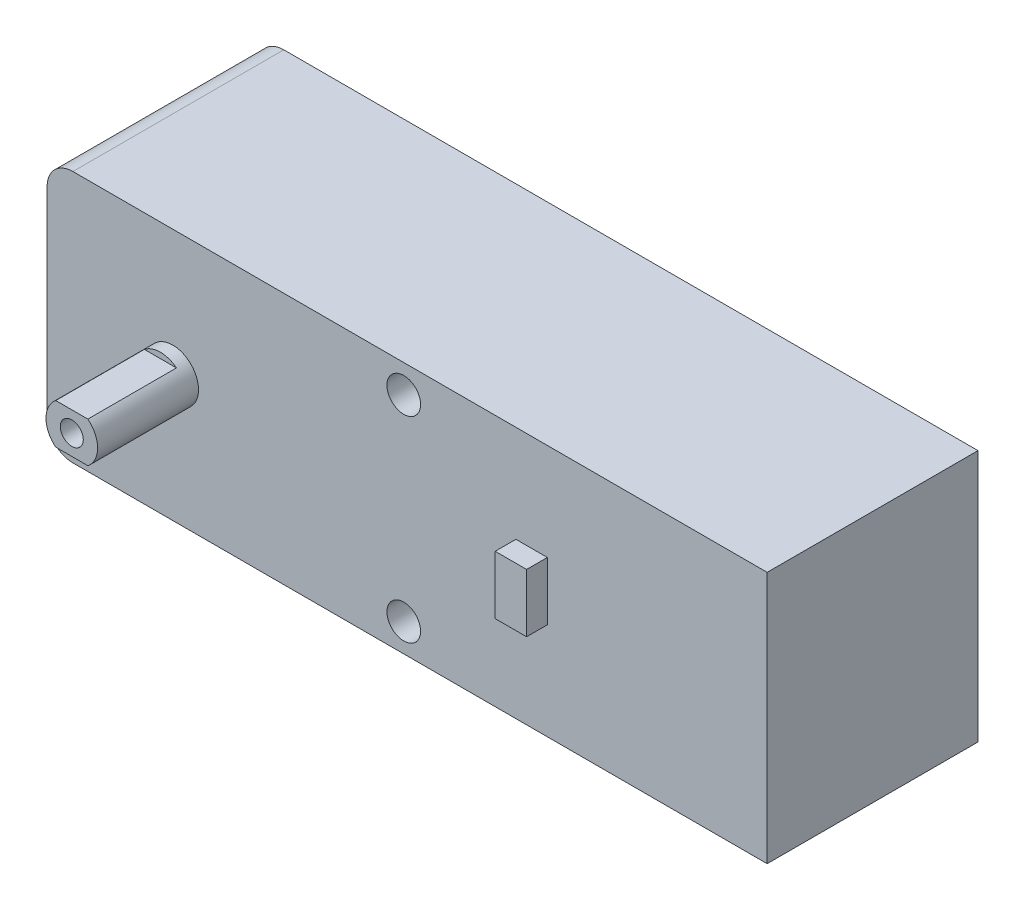
ISO-10303-21;
HEADER;
FILE_DESCRIPTION(('STEP AP214'),'2;1');
FILE_NAME('part.step','',(''),(''),'','','');
FILE_SCHEMA(('AUTOMOTIVE_DESIGN { 1 0 10303 214 1 1 1 1 }'));
ENDSEC;
DATA;
#1=APPLICATION_CONTEXT('core data for automotive mechanical design processes');
#2=APPLICATION_PROTOCOL_DEFINITION('international standard','automotive_design',2000,#1);
#3=PRODUCT_CONTEXT('',#1,'mechanical');
#4=PRODUCT('Part','Part','',(#3));
#5=PRODUCT_RELATED_PRODUCT_CATEGORY('part','',(#4));
#6=PRODUCT_DEFINITION_FORMATION('','',#4);
#7=PRODUCT_DEFINITION_CONTEXT('part definition',#1,'design');
#8=PRODUCT_DEFINITION('design','',#6,#7);
#9=PRODUCT_DEFINITION_SHAPE('','',#8);
#10=(LENGTH_UNIT() NAMED_UNIT(*) SI_UNIT(.MILLI.,.METRE.));
#11=(NAMED_UNIT(*) PLANE_ANGLE_UNIT() SI_UNIT($,.RADIAN.));
#12=(NAMED_UNIT(*) SI_UNIT($,.STERADIAN.) SOLID_ANGLE_UNIT());
#13=UNCERTAINTY_MEASURE_WITH_UNIT(LENGTH_MEASURE(1.E-05),#10,'distance_accuracy_value','');
#14=(GEOMETRIC_REPRESENTATION_CONTEXT(3) GLOBAL_UNCERTAINTY_ASSIGNED_CONTEXT((#13)) GLOBAL_UNIT_ASSIGNED_CONTEXT((#10,
#11,#12)) REPRESENTATION_CONTEXT('',''));
#15=CARTESIAN_POINT('',(0.,0.,0.));
#16=DIRECTION('',(0.,0.,1.));
#17=DIRECTION('',(1.,0.,0.));
#18=AXIS2_PLACEMENT_3D('',#15,#16,#17);
#19=CARTESIAN_POINT('',(0.,0.,9.4));
#20=DIRECTION('',(0.,0.,-1.));
#21=DIRECTION('',(-1.,0.,0.));
#22=AXIS2_PLACEMENT_3D('',#19,#20,#21);
#23=PLANE('',#22);
#24=CARTESIAN_POINT('',(11.2,11.25,9.4));
#25=DIRECTION('',(0.,0.,-1.));
#26=DIRECTION('',(-1.,0.,0.));
#27=AXIS2_PLACEMENT_3D('',#24,#25,#26);
#28=CIRCLE('',#27,2.3);
#29=CARTESIAN_POINT('',(8.9,11.25,9.4));
#30=VERTEX_POINT('',#29);
#31=EDGE_CURVE('E363',#30,#30,#28,.F.);
#32=ORIENTED_EDGE('',*,*,#31,.F.);
#33=EDGE_LOOP('',(#32));
#34=FACE_BOUND('',#33,.T.);
#35=DIRECTION('',(0.,-1.,0.));
#36=VECTOR('',#35,1.);
#37=CARTESIAN_POINT('',(0.,0.,9.4));
#38=LINE('',#37,#36);
#39=CARTESIAN_POINT('',(0.,20.2,9.4));
#40=VERTEX_POINT('',#39);
#41=CARTESIAN_POINT('',(0.,2.3,9.4));
#42=VERTEX_POINT('',#41);
#43=EDGE_CURVE('E328',#40,#42,#38,.T.);
#44=ORIENTED_EDGE('',*,*,#43,.T.);
#45=CARTESIAN_POINT('',(2.3,2.3,9.4));
#46=DIRECTION('',(0.,0.,-1.));
#47=DIRECTION('',(-1.,0.,0.));
#48=AXIS2_PLACEMENT_3D('',#45,#46,#47);
#49=CIRCLE('',#48,2.3);
#50=CARTESIAN_POINT('',(2.3,0.,9.4));
#51=VERTEX_POINT('',#50);
#52=EDGE_CURVE('E61',#42,#51,#49,.F.);
#53=ORIENTED_EDGE('',*,*,#52,.T.);
#54=DIRECTION('',(1.,0.,0.));
#55=VECTOR('',#54,1.);
#56=CARTESIAN_POINT('',(0.,0.,9.4));
#57=LINE('',#56,#55);
#58=CARTESIAN_POINT('',(64.2,0.,9.4));
#59=VERTEX_POINT('',#58);
#60=EDGE_CURVE('E332',#51,#59,#57,.T.);
#61=ORIENTED_EDGE('',*,*,#60,.T.);
#62=DIRECTION('',(0.,1.,0.));
#63=VECTOR('',#62,1.);
#64=CARTESIAN_POINT('',(64.2,0.,9.4));
#65=LINE('',#64,#63);
#66=CARTESIAN_POINT('',(64.2,22.5,9.4));
#67=VERTEX_POINT('',#66);
#68=EDGE_CURVE('E336',#59,#67,#65,.T.);
#69=ORIENTED_EDGE('',*,*,#68,.T.);
#70=DIRECTION('',(-1.,0.,0.));
#71=VECTOR('',#70,1.);
#72=CARTESIAN_POINT('',(0.,22.5,9.4));
#73=LINE('',#72,#71);
#74=CARTESIAN_POINT('',(2.3,22.5,9.4));
#75=VERTEX_POINT('',#74);
#76=EDGE_CURVE('E339',#67,#75,#73,.T.);
#77=ORIENTED_EDGE('',*,*,#76,.T.);
#78=CARTESIAN_POINT('',(2.3,20.2,9.4));
#79=DIRECTION('',(0.,0.,-1.));
#80=DIRECTION('',(-1.,0.,0.));
#81=AXIS2_PLACEMENT_3D('',#78,#79,#80);
#82=CIRCLE('',#81,2.3);
#83=EDGE_CURVE('E388',#75,#40,#82,.F.);
#84=ORIENTED_EDGE('',*,*,#83,.T.);
#85=EDGE_LOOP('',(#44,#53,#61,#69,#77,#84));
#86=FACE_BOUND('',#85,.T.);
#87=CARTESIAN_POINT('',(31.8,20.,9.4));
#88=DIRECTION('',(0.,0.,1.));
#89=DIRECTION('',(1.,0.,0.));
#90=AXIS2_PLACEMENT_3D('',#87,#88,#89);
#91=CIRCLE('',#90,1.5);
#92=CARTESIAN_POINT('',(33.3,20.,9.4));
#93=VERTEX_POINT('',#92);
#94=EDGE_CURVE('E276',#93,#93,#91,.T.);
#95=ORIENTED_EDGE('',*,*,#94,.F.);
#96=EDGE_LOOP('',(#95));
#97=FACE_BOUND('',#96,.T.);
#98=CARTESIAN_POINT('',(31.8,2.5,9.4));
#99=DIRECTION('',(0.,0.,1.));
#100=DIRECTION('',(1.,0.,0.));
#101=AXIS2_PLACEMENT_3D('',#98,#99,#100);
#102=CIRCLE('',#101,1.5);
#103=CARTESIAN_POINT('',(33.3,2.5,9.4));
#104=VERTEX_POINT('',#103);
#105=EDGE_CURVE('E271',#104,#104,#102,.T.);
#106=ORIENTED_EDGE('',*,*,#105,.F.);
#107=EDGE_LOOP('',(#106));
#108=FACE_BOUND('',#107,.T.);
#109=DIRECTION('',(0.,-1.,0.));
#110=VECTOR('',#109,1.);
#111=CARTESIAN_POINT('',(41.8,13.85,9.4));
#112=LINE('',#111,#110);
#113=CARTESIAN_POINT('',(41.8,13.85,9.4));
#114=VERTEX_POINT('',#113);
#115=CARTESIAN_POINT('',(41.8,8.65,9.4));
#116=VERTEX_POINT('',#115);
#117=EDGE_CURVE('E205',#114,#116,#112,.T.);
#118=ORIENTED_EDGE('',*,*,#117,.F.);
#119=DIRECTION('',(-1.,0.,0.));
#120=VECTOR('',#119,1.);
#121=CARTESIAN_POINT('',(41.8,13.85,9.4));
#122=LINE('',#121,#120);
#123=CARTESIAN_POINT('',(44.6,13.85,9.4));
#124=VERTEX_POINT('',#123);
#125=EDGE_CURVE('E202',#124,#114,#122,.T.);
#126=ORIENTED_EDGE('',*,*,#125,.F.);
#127=DIRECTION('',(0.,1.,0.));
#128=VECTOR('',#127,1.);
#129=CARTESIAN_POINT('',(44.6,13.85,9.4));
#130=LINE('',#129,#128);
#131=CARTESIAN_POINT('',(44.6,8.65,9.4));
#132=VERTEX_POINT('',#131);
#133=EDGE_CURVE('E73',#132,#124,#130,.T.);
#134=ORIENTED_EDGE('',*,*,#133,.F.);
#135=DIRECTION('',(1.,0.,0.));
#136=VECTOR('',#135,1.);
#137=CARTESIAN_POINT('',(41.8,8.65,9.4));
#138=LINE('',#137,#136);
#139=EDGE_CURVE('E68',#116,#132,#138,.T.);
#140=ORIENTED_EDGE('',*,*,#139,.F.);
#141=EDGE_LOOP('',(#118,#126,#134,#140));
#142=FACE_BOUND('',#141,.T.);
#143=ADVANCED_FACE('F52',(#34,#86,#97,#108,#142),#23,.F.);
#144=CARTESIAN_POINT('',(11.2,11.25,-18.4));
#145=DIRECTION('',(0.,0.,1.));
#146=DIRECTION('',(1.,0.,0.));
#147=AXIS2_PLACEMENT_3D('',#144,#145,#146);
#148=CYLINDRICAL_SURFACE('',#147,2.3);
#149=CARTESIAN_POINT('',(11.2,11.25,-9.4));
#150=DIRECTION('',(0.,0.,-1.));
#151=DIRECTION('',(-1.,0.,0.));
#152=AXIS2_PLACEMENT_3D('',#149,#150,#151);
#153=CIRCLE('',#152,2.3);
#154=CARTESIAN_POINT('',(8.9,11.25,-9.4));
#155=VERTEX_POINT('',#154);
#156=EDGE_CURVE('E367',#155,#155,#153,.T.);
#157=ORIENTED_EDGE('',*,*,#156,.T.);
#158=EDGE_LOOP('',(#157));
#159=FACE_BOUND('',#158,.T.);
#160=CARTESIAN_POINT('',(11.2,11.25,-10.5));
#161=DIRECTION('',(0.,0.,1.));
#162=DIRECTION('',(1.,0.,0.));
#163=AXIS2_PLACEMENT_3D('',#160,#161,#162);
#164=CIRCLE('',#163,2.3);
#165=CARTESIAN_POINT('',(9.76821789367237,9.45,-10.5));
#166=VERTEX_POINT('',#165);
#167=CARTESIAN_POINT('',(12.6317821063276,9.45,-10.5));
#168=VERTEX_POINT('',#167);
#169=EDGE_CURVE('E222',#166,#168,#164,.T.);
#170=ORIENTED_EDGE('',*,*,#169,.T.);
#171=DIRECTION('',(0.,0.,-1.));
#172=VECTOR('',#171,1.);
#173=CARTESIAN_POINT('',(12.6317821063276,9.45,-10.5));
#174=LINE('',#173,#172);
#175=CARTESIAN_POINT('',(12.6317821063276,9.45,-18.4));
#176=VERTEX_POINT('',#175);
#177=EDGE_CURVE('E233',#168,#176,#174,.T.);
#178=ORIENTED_EDGE('',*,*,#177,.T.);
#179=CARTESIAN_POINT('',(11.2,11.25,-18.4));
#180=DIRECTION('',(0.,0.,1.));
#181=DIRECTION('',(1.,0.,0.));
#182=AXIS2_PLACEMENT_3D('',#179,#180,#181);
#183=CIRCLE('',#182,2.3);
#184=CARTESIAN_POINT('',(12.6317821063276,13.05,-18.4));
#185=VERTEX_POINT('',#184);
#186=EDGE_CURVE('E255',#176,#185,#183,.T.);
#187=ORIENTED_EDGE('',*,*,#186,.T.);
#188=DIRECTION('',(0.,0.,-1.));
#189=VECTOR('',#188,1.);
#190=CARTESIAN_POINT('',(12.6317821063276,13.05,-10.5));
#191=LINE('',#190,#189);
#192=CARTESIAN_POINT('',(12.6317821063276,13.05,-10.5));
#193=VERTEX_POINT('',#192);
#194=EDGE_CURVE('E247',#193,#185,#191,.T.);
#195=ORIENTED_EDGE('',*,*,#194,.F.);
#196=CARTESIAN_POINT('',(11.2,11.25,-10.5));
#197=DIRECTION('',(0.,0.,1.));
#198=DIRECTION('',(1.,0.,0.));
#199=AXIS2_PLACEMENT_3D('',#196,#197,#198);
#200=CIRCLE('',#199,2.3);
#201=CARTESIAN_POINT('',(9.76821789367237,13.05,-10.5));
#202=VERTEX_POINT('',#201);
#203=EDGE_CURVE('E240',#193,#202,#200,.T.);
#204=ORIENTED_EDGE('',*,*,#203,.T.);
#205=DIRECTION('',(0.,0.,-1.));
#206=VECTOR('',#205,1.);
#207=CARTESIAN_POINT('',(9.76821789367237,13.05,-10.5));
#208=LINE('',#207,#206);
#209=CARTESIAN_POINT('',(9.76821789367237,13.05,-18.4));
#210=VERTEX_POINT('',#209);
#211=EDGE_CURVE('E251',#202,#210,#208,.T.);
#212=ORIENTED_EDGE('',*,*,#211,.T.);
#213=CARTESIAN_POINT('',(9.76821789367237,9.45,-18.4));
#214=VERTEX_POINT('',#213);
#215=EDGE_CURVE('E259',#210,#214,#183,.T.);
#216=ORIENTED_EDGE('',*,*,#215,.T.);
#217=DIRECTION('',(0.,0.,-1.));
#218=VECTOR('',#217,1.);
#219=CARTESIAN_POINT('',(9.76821789367237,9.45,-10.5));
#220=LINE('',#219,#218);
#221=EDGE_CURVE('E229',#166,#214,#220,.T.);
#222=ORIENTED_EDGE('',*,*,#221,.F.);
#223=EDGE_LOOP('',(#170,#178,#187,#195,#204,#212,#216,#222));
#224=FACE_BOUND('',#223,.T.);
#225=ADVANCED_FACE('F432',(#159,#224),#148,.T.);
#226=CARTESIAN_POINT('',(11.2,11.25,-18.4));
#227=DIRECTION('',(0.,0.,-1.));
#228=DIRECTION('',(1.,0.,0.));
#229=AXIS2_PLACEMENT_3D('',#226,#227,#228);
#230=PLANE('',#229);
#231=CARTESIAN_POINT('',(11.2,11.25,-18.4));
#232=DIRECTION('',(0.,0.,-1.));
#233=DIRECTION('',(-1.,0.,0.));
#234=AXIS2_PLACEMENT_3D('',#231,#232,#233);
#235=CIRCLE('',#234,1.025);
#236=CARTESIAN_POINT('',(10.175,11.25,-18.4));
#237=VERTEX_POINT('',#236);
#238=EDGE_CURVE('E207',#237,#237,#235,.T.);
#239=ORIENTED_EDGE('',*,*,#238,.F.);
#240=EDGE_LOOP('',(#239));
#241=FACE_BOUND('',#240,.T.);
#242=ORIENTED_EDGE('',*,*,#186,.F.);
#243=DIRECTION('',(-1.,0.,0.));
#244=VECTOR('',#243,1.);
#245=CARTESIAN_POINT('',(12.6317821063276,9.45,-18.4));
#246=LINE('',#245,#244);
#247=EDGE_CURVE('E221',#176,#214,#246,.T.);
#248=ORIENTED_EDGE('',*,*,#247,.T.);
#249=ORIENTED_EDGE('',*,*,#215,.F.);
#250=DIRECTION('',(1.,0.,0.));
#251=VECTOR('',#250,1.);
#252=CARTESIAN_POINT('',(9.76821789367237,13.05,-18.4));
#253=LINE('',#252,#251);
#254=EDGE_CURVE('E237',#210,#185,#253,.T.);
#255=ORIENTED_EDGE('',*,*,#254,.T.);
#256=EDGE_LOOP('',(#242,#248,#249,#255));
#257=FACE_BOUND('',#256,.T.);
#258=ADVANCED_FACE('F440',(#241,#257),#230,.T.);
#259=CARTESIAN_POINT('',(0.,0.,9.4));
#260=DIRECTION('',(1.,0.,0.));
#261=DIRECTION('',(0.,0.,-1.));
#262=AXIS2_PLACEMENT_3D('',#259,#260,#261);
#263=PLANE('',#262);
#264=DIRECTION('',(0.,-1.,0.));
#265=VECTOR('',#264,1.);
#266=CARTESIAN_POINT('',(0.,0.,-9.4));
#267=LINE('',#266,#265);
#268=CARTESIAN_POINT('',(0.,20.2,-9.4));
#269=VERTEX_POINT('',#268);
#270=CARTESIAN_POINT('',(0.,2.3,-9.4));
#271=VERTEX_POINT('',#270);
#272=EDGE_CURVE('E327',#269,#271,#267,.T.);
#273=ORIENTED_EDGE('',*,*,#272,.T.);
#274=DIRECTION('',(0.,0.,-1.));
#275=VECTOR('',#274,1.);
#276=CARTESIAN_POINT('',(0.,2.3,9.4));
#277=LINE('',#276,#275);
#278=EDGE_CURVE('E385',#271,#42,#277,.F.);
#279=ORIENTED_EDGE('',*,*,#278,.T.);
#280=ORIENTED_EDGE('',*,*,#43,.F.);
#281=DIRECTION('',(0.,0.,-1.));
#282=VECTOR('',#281,1.);
#283=CARTESIAN_POINT('',(0.,20.2,9.4));
#284=LINE('',#283,#282);
#285=EDGE_CURVE('E381',#40,#269,#284,.T.);
#286=ORIENTED_EDGE('',*,*,#285,.T.);
#287=EDGE_LOOP('',(#273,#279,#280,#286));
#288=FACE_BOUND('',#287,.T.);
#289=ADVANCED_FACE('F410',(#288),#263,.F.);
#290=CARTESIAN_POINT('',(0.,0.,9.4));
#291=DIRECTION('',(0.,1.,0.));
#292=DIRECTION('',(0.,0.,1.));
#293=AXIS2_PLACEMENT_3D('',#290,#291,#292);
#294=PLANE('',#293);
#295=ORIENTED_EDGE('',*,*,#60,.F.);
#296=DIRECTION('',(0.,0.,-1.));
#297=VECTOR('',#296,1.);
#298=CARTESIAN_POINT('',(2.3,0.,9.4));
#299=LINE('',#298,#297);
#300=CARTESIAN_POINT('',(2.3,0.,-9.4));
#301=VERTEX_POINT('',#300);
#302=EDGE_CURVE('E371',#51,#301,#299,.T.);
#303=ORIENTED_EDGE('',*,*,#302,.T.);
#304=DIRECTION('',(1.,0.,0.));
#305=VECTOR('',#304,1.);
#306=CARTESIAN_POINT('',(0.,0.,-9.4));
#307=LINE('',#306,#305);
#308=CARTESIAN_POINT('',(64.2,0.,-9.4));
#309=VERTEX_POINT('',#308);
#310=EDGE_CURVE('E347',#301,#309,#307,.T.);
#311=ORIENTED_EDGE('',*,*,#310,.T.);
#312=DIRECTION('',(0.,0.,-1.));
#313=VECTOR('',#312,1.);
#314=CARTESIAN_POINT('',(64.2,0.,9.4));
#315=LINE('',#314,#313);
#316=EDGE_CURVE('E359',#59,#309,#315,.T.);
#317=ORIENTED_EDGE('',*,*,#316,.F.);
#318=EDGE_LOOP('',(#295,#303,#311,#317));
#319=FACE_BOUND('',#318,.T.);
#320=ADVANCED_FACE('F401',(#319),#294,.F.);
#321=CARTESIAN_POINT('',(64.2,0.,9.4));
#322=DIRECTION('',(-1.,0.,0.));
#323=DIRECTION('',(0.,0.,1.));
#324=AXIS2_PLACEMENT_3D('',#321,#322,#323);
#325=PLANE('',#324);
#326=DIRECTION('',(0.,1.,0.));
#327=VECTOR('',#326,1.);
#328=CARTESIAN_POINT('',(64.2,0.,-9.4));
#329=LINE('',#328,#327);
#330=CARTESIAN_POINT('',(64.2,22.5,-9.4));
#331=VERTEX_POINT('',#330);
#332=EDGE_CURVE('E350',#309,#331,#329,.T.);
#333=ORIENTED_EDGE('',*,*,#332,.T.);
#334=DIRECTION('',(0.,0.,-1.));
#335=VECTOR('',#334,1.);
#336=CARTESIAN_POINT('',(64.2,22.5,9.4));
#337=LINE('',#336,#335);
#338=EDGE_CURVE('E343',#67,#331,#337,.T.);
#339=ORIENTED_EDGE('',*,*,#338,.F.);
#340=ORIENTED_EDGE('',*,*,#68,.F.);
#341=ORIENTED_EDGE('',*,*,#316,.T.);
#342=EDGE_LOOP('',(#333,#339,#340,#341));
#343=FACE_BOUND('',#342,.T.);
#344=ADVANCED_FACE('F421',(#343),#325,.F.);
#345=CARTESIAN_POINT('',(0.,22.5,9.4));
#346=DIRECTION('',(0.,-1.,0.));
#347=DIRECTION('',(0.,0.,-1.));
#348=AXIS2_PLACEMENT_3D('',#345,#346,#347);
#349=PLANE('',#348);
#350=DIRECTION('',(-1.,0.,0.));
#351=VECTOR('',#350,1.);
#352=CARTESIAN_POINT('',(0.,22.5,-9.4));
#353=LINE('',#352,#351);
#354=CARTESIAN_POINT('',(2.3,22.5,-9.4));
#355=VERTEX_POINT('',#354);
#356=EDGE_CURVE('E333',#331,#355,#353,.T.);
#357=ORIENTED_EDGE('',*,*,#356,.T.);
#358=DIRECTION('',(0.,0.,-1.));
#359=VECTOR('',#358,1.);
#360=CARTESIAN_POINT('',(2.3,22.5,9.4));
#361=LINE('',#360,#359);
#362=EDGE_CURVE('E11',#355,#75,#361,.F.);
#363=ORIENTED_EDGE('',*,*,#362,.T.);
#364=ORIENTED_EDGE('',*,*,#76,.F.);
#365=ORIENTED_EDGE('',*,*,#338,.T.);
#366=EDGE_LOOP('',(#357,#363,#364,#365));
#367=FACE_BOUND('',#366,.T.);
#368=ADVANCED_FACE('F417',(#367),#349,.F.);
#369=CARTESIAN_POINT('',(0.,0.,-9.4));
#370=DIRECTION('',(0.,0.,-1.));
#371=DIRECTION('',(-1.,0.,0.));
#372=AXIS2_PLACEMENT_3D('',#369,#370,#371);
#373=PLANE('',#372);
#374=ORIENTED_EDGE('',*,*,#156,.F.);
#375=EDGE_LOOP('',(#374));
#376=FACE_BOUND('',#375,.T.);
#377=CARTESIAN_POINT('',(31.8,2.5,-9.4));
#378=DIRECTION('',(0.,0.,1.));
#379=DIRECTION('',(1.,0.,0.));
#380=AXIS2_PLACEMENT_3D('',#377,#378,#379);
#381=CIRCLE('',#380,1.5);
#382=CARTESIAN_POINT('',(33.3,2.5,-9.4));
#383=VERTEX_POINT('',#382);
#384=EDGE_CURVE('E272',#383,#383,#381,.T.);
#385=ORIENTED_EDGE('',*,*,#384,.T.);
#386=EDGE_LOOP('',(#385));
#387=FACE_BOUND('',#386,.T.);
#388=CARTESIAN_POINT('',(31.8,20.,-9.4));
#389=DIRECTION('',(0.,0.,1.));
#390=DIRECTION('',(1.,0.,0.));
#391=AXIS2_PLACEMENT_3D('',#388,#389,#390);
#392=CIRCLE('',#391,1.5);
#393=CARTESIAN_POINT('',(33.3,20.,-9.4));
#394=VERTEX_POINT('',#393);
#395=EDGE_CURVE('E280',#394,#394,#392,.T.);
#396=ORIENTED_EDGE('',*,*,#395,.T.);
#397=EDGE_LOOP('',(#396));
#398=FACE_BOUND('',#397,.T.);
#399=ORIENTED_EDGE('',*,*,#310,.F.);
#400=CARTESIAN_POINT('',(2.3,2.3,-9.4));
#401=DIRECTION('',(0.,0.,-1.));
#402=DIRECTION('',(-1.,0.,0.));
#403=AXIS2_PLACEMENT_3D('',#400,#401,#402);
#404=CIRCLE('',#403,2.3);
#405=EDGE_CURVE('E378',#301,#271,#404,.T.);
#406=ORIENTED_EDGE('',*,*,#405,.T.);
#407=ORIENTED_EDGE('',*,*,#272,.F.);
#408=CARTESIAN_POINT('',(2.3,20.2,-9.4));
#409=DIRECTION('',(0.,0.,-1.));
#410=DIRECTION('',(-1.,0.,0.));
#411=AXIS2_PLACEMENT_3D('',#408,#409,#410);
#412=CIRCLE('',#411,2.3);
#413=EDGE_CURVE('E375',#269,#355,#412,.T.);
#414=ORIENTED_EDGE('',*,*,#413,.T.);
#415=ORIENTED_EDGE('',*,*,#356,.F.);
#416=ORIENTED_EDGE('',*,*,#332,.F.);
#417=EDGE_LOOP('',(#399,#406,#407,#414,#415,#416));
#418=FACE_BOUND('',#417,.T.);
#419=ADVANCED_FACE('F407',(#376,#387,#398,#418),#373,.T.);
#420=CARTESIAN_POINT('',(11.2,11.25,18.4));
#421=DIRECTION('',(0.,0.,-1.));
#422=DIRECTION('',(-1.,0.,0.));
#423=AXIS2_PLACEMENT_3D('',#420,#421,#422);
#424=CYLINDRICAL_SURFACE('',#423,2.3);
#425=CARTESIAN_POINT('',(11.2,11.25,18.4));
#426=DIRECTION('',(0.,0.,1.));
#427=DIRECTION('',(1.,0.,0.));
#428=AXIS2_PLACEMENT_3D('',#425,#426,#427);
#429=CIRCLE('',#428,2.3);
#430=CARTESIAN_POINT('',(12.6317821063276,9.45,18.4));
#431=VERTEX_POINT('',#430);
#432=CARTESIAN_POINT('',(12.6317821063276,13.05,18.4));
#433=VERTEX_POINT('',#432);
#434=EDGE_CURVE('E320',#431,#433,#429,.T.);
#435=ORIENTED_EDGE('',*,*,#434,.F.);
#436=DIRECTION('',(0.,0.,1.));
#437=VECTOR('',#436,1.);
#438=CARTESIAN_POINT('',(12.6317821063276,9.45,10.5));
#439=LINE('',#438,#437);
#440=CARTESIAN_POINT('',(12.6317821063276,9.45,10.5));
#441=VERTEX_POINT('',#440);
#442=EDGE_CURVE('E295',#441,#431,#439,.T.);
#443=ORIENTED_EDGE('',*,*,#442,.F.);
#444=CARTESIAN_POINT('',(11.2,11.25,10.5));
#445=DIRECTION('',(0.,0.,1.));
#446=DIRECTION('',(1.,0.,0.));
#447=AXIS2_PLACEMENT_3D('',#444,#445,#446);
#448=CIRCLE('',#447,2.3);
#449=CARTESIAN_POINT('',(9.76821789367237,9.45,10.5));
#450=VERTEX_POINT('',#449);
#451=EDGE_CURVE('E288',#450,#441,#448,.T.);
#452=ORIENTED_EDGE('',*,*,#451,.F.);
#453=DIRECTION('',(0.,0.,1.));
#454=VECTOR('',#453,1.);
#455=CARTESIAN_POINT('',(9.76821789367237,9.45,10.5));
#456=LINE('',#455,#454);
#457=CARTESIAN_POINT('',(9.76821789367237,9.45,18.4));
#458=VERTEX_POINT('',#457);
#459=EDGE_CURVE('E298',#450,#458,#456,.T.);
#460=ORIENTED_EDGE('',*,*,#459,.T.);
#461=CARTESIAN_POINT('',(9.76821789367237,13.05,18.4));
#462=VERTEX_POINT('',#461);
#463=EDGE_CURVE('E323',#462,#458,#429,.T.);
#464=ORIENTED_EDGE('',*,*,#463,.F.);
#465=DIRECTION('',(0.,0.,1.));
#466=VECTOR('',#465,1.);
#467=CARTESIAN_POINT('',(9.76821789367237,13.05,10.5));
#468=LINE('',#467,#466);
#469=CARTESIAN_POINT('',(9.76821789367237,13.05,10.5));
#470=VERTEX_POINT('',#469);
#471=EDGE_CURVE('E312',#470,#462,#468,.T.);
#472=ORIENTED_EDGE('',*,*,#471,.F.);
#473=CARTESIAN_POINT('',(11.2,11.25,10.5));
#474=DIRECTION('',(0.,0.,1.));
#475=DIRECTION('',(1.,0.,0.));
#476=AXIS2_PLACEMENT_3D('',#473,#474,#475);
#477=CIRCLE('',#476,2.3);
#478=CARTESIAN_POINT('',(12.6317821063276,13.05,10.5));
#479=VERTEX_POINT('',#478);
#480=EDGE_CURVE('E305',#479,#470,#477,.T.);
#481=ORIENTED_EDGE('',*,*,#480,.F.);
#482=DIRECTION('',(0.,0.,1.));
#483=VECTOR('',#482,1.);
#484=CARTESIAN_POINT('',(12.6317821063276,13.05,10.5));
#485=LINE('',#484,#483);
#486=EDGE_CURVE('E316',#479,#433,#485,.T.);
#487=ORIENTED_EDGE('',*,*,#486,.T.);
#488=EDGE_LOOP('',(#435,#443,#452,#460,#464,#472,#481,#487));
#489=FACE_BOUND('',#488,.T.);
#490=ORIENTED_EDGE('',*,*,#31,.T.);
#491=EDGE_LOOP('',(#490));
#492=FACE_BOUND('',#491,.T.);
#493=ADVANCED_FACE('F446',(#489,#492),#424,.T.);
#494=CARTESIAN_POINT('',(11.2,11.25,18.4));
#495=DIRECTION('',(0.,0.,1.));
#496=DIRECTION('',(1.,0.,0.));
#497=AXIS2_PLACEMENT_3D('',#494,#495,#496);
#498=PLANE('',#497);
#499=CARTESIAN_POINT('',(11.2,11.25,18.4));
#500=DIRECTION('',(0.,0.,1.));
#501=DIRECTION('',(1.,0.,0.));
#502=AXIS2_PLACEMENT_3D('',#499,#500,#501);
#503=CIRCLE('',#502,1.025);
#504=CARTESIAN_POINT('',(12.225,11.25,18.4));
#505=VERTEX_POINT('',#504);
#506=EDGE_CURVE('E263',#505,#505,#503,.T.);
#507=ORIENTED_EDGE('',*,*,#506,.F.);
#508=EDGE_LOOP('',(#507));
#509=FACE_BOUND('',#508,.T.);
#510=DIRECTION('',(-1.,0.,0.));
#511=VECTOR('',#510,1.);
#512=CARTESIAN_POINT('',(12.6317821063276,9.45,18.4));
#513=LINE('',#512,#511);
#514=EDGE_CURVE('E284',#431,#458,#513,.T.);
#515=ORIENTED_EDGE('',*,*,#514,.F.);
#516=ORIENTED_EDGE('',*,*,#434,.T.);
#517=DIRECTION('',(1.,0.,0.));
#518=VECTOR('',#517,1.);
#519=CARTESIAN_POINT('',(9.76821789367237,13.05,18.4));
#520=LINE('',#519,#518);
#521=EDGE_CURVE('E302',#462,#433,#520,.T.);
#522=ORIENTED_EDGE('',*,*,#521,.F.);
#523=ORIENTED_EDGE('',*,*,#463,.T.);
#524=EDGE_LOOP('',(#515,#516,#522,#523));
#525=FACE_BOUND('',#524,.T.);
#526=ADVANCED_FACE('F453',(#509,#525),#498,.T.);
#527=CARTESIAN_POINT('',(9.76821789367237,13.05,10.5));
#528=DIRECTION('',(0.,-1.,0.));
#529=DIRECTION('',(0.,0.,-1.));
#530=AXIS2_PLACEMENT_3D('',#527,#528,#529);
#531=PLANE('',#530);
#532=ORIENTED_EDGE('',*,*,#521,.T.);
#533=ORIENTED_EDGE('',*,*,#486,.F.);
#534=DIRECTION('',(1.,0.,0.));
#535=VECTOR('',#534,1.);
#536=CARTESIAN_POINT('',(9.76821789367237,13.05,10.5));
#537=LINE('',#536,#535);
#538=EDGE_CURVE('E308',#470,#479,#537,.T.);
#539=ORIENTED_EDGE('',*,*,#538,.F.);
#540=ORIENTED_EDGE('',*,*,#471,.T.);
#541=EDGE_LOOP('',(#532,#533,#539,#540));
#542=FACE_BOUND('',#541,.T.);
#543=ADVANCED_FACE('F552',(#542),#531,.F.);
#544=CARTESIAN_POINT('',(11.2,11.25,10.5));
#545=DIRECTION('',(0.,0.,1.));
#546=DIRECTION('',(1.,0.,0.));
#547=AXIS2_PLACEMENT_3D('',#544,#545,#546);
#548=PLANE('',#547);
#549=ORIENTED_EDGE('',*,*,#480,.T.);
#550=ORIENTED_EDGE('',*,*,#538,.T.);
#551=EDGE_LOOP('',(#549,#550));
#552=FACE_BOUND('',#551,.T.);
#553=ADVANCED_FACE('F548',(#552),#548,.T.);
#554=CARTESIAN_POINT('',(12.6317821063276,9.45,10.5));
#555=DIRECTION('',(0.,1.,0.));
#556=DIRECTION('',(0.,0.,1.));
#557=AXIS2_PLACEMENT_3D('',#554,#555,#556);
#558=PLANE('',#557);
#559=ORIENTED_EDGE('',*,*,#514,.T.);
#560=ORIENTED_EDGE('',*,*,#459,.F.);
#561=DIRECTION('',(-1.,0.,0.));
#562=VECTOR('',#561,1.);
#563=CARTESIAN_POINT('',(12.6317821063276,9.45,10.5));
#564=LINE('',#563,#562);
#565=EDGE_CURVE('E291',#441,#450,#564,.T.);
#566=ORIENTED_EDGE('',*,*,#565,.F.);
#567=ORIENTED_EDGE('',*,*,#442,.T.);
#568=EDGE_LOOP('',(#559,#560,#566,#567));
#569=FACE_BOUND('',#568,.T.);
#570=ADVANCED_FACE('F544',(#569),#558,.F.);
#571=CARTESIAN_POINT('',(11.2,11.25,10.5));
#572=DIRECTION('',(0.,0.,1.));
#573=DIRECTION('',(1.,0.,0.));
#574=AXIS2_PLACEMENT_3D('',#571,#572,#573);
#575=PLANE('',#574);
#576=ORIENTED_EDGE('',*,*,#451,.T.);
#577=ORIENTED_EDGE('',*,*,#565,.T.);
#578=EDGE_LOOP('',(#576,#577));
#579=FACE_BOUND('',#578,.T.);
#580=ADVANCED_FACE('F465',(#579),#575,.T.);
#581=CARTESIAN_POINT('',(31.8,20.,-9.4));
#582=DIRECTION('',(0.,0.,1.));
#583=DIRECTION('',(1.,0.,0.));
#584=AXIS2_PLACEMENT_3D('',#581,#582,#583);
#585=CYLINDRICAL_SURFACE('',#584,1.5);
#586=ORIENTED_EDGE('',*,*,#395,.F.);
#587=EDGE_LOOP('',(#586));
#588=FACE_BOUND('',#587,.T.);
#589=ORIENTED_EDGE('',*,*,#94,.T.);
#590=EDGE_LOOP('',(#589));
#591=FACE_BOUND('',#590,.T.);
#592=ADVANCED_FACE('F461',(#588,#591),#585,.F.);
#593=CARTESIAN_POINT('',(31.8,2.5,-9.4));
#594=DIRECTION('',(0.,0.,1.));
#595=DIRECTION('',(1.,0.,0.));
#596=AXIS2_PLACEMENT_3D('',#593,#594,#595);
#597=CYLINDRICAL_SURFACE('',#596,1.5);
#598=ORIENTED_EDGE('',*,*,#384,.F.);
#599=EDGE_LOOP('',(#598));
#600=FACE_BOUND('',#599,.T.);
#601=ORIENTED_EDGE('',*,*,#105,.T.);
#602=EDGE_LOOP('',(#601));
#603=FACE_BOUND('',#602,.T.);
#604=ADVANCED_FACE('F464',(#600,#603),#597,.F.);
#605=CARTESIAN_POINT('',(11.2,11.25,11.15));
#606=DIRECTION('',(0.,0.,1.));
#607=DIRECTION('',(1.,0.,0.));
#608=AXIS2_PLACEMENT_3D('',#605,#606,#607);
#609=CONICAL_SURFACE('',#608,1.025,1.02974425867665);
#610=CARTESIAN_POINT('',(11.2,11.25,10.5341178654967));
#611=VERTEX_POINT('',#610);
#612=VERTEX_LOOP('',#611);
#613=FACE_BOUND('',#612,.T.);
#614=CARTESIAN_POINT('',(11.2,11.25,11.15));
#615=DIRECTION('',(0.,0.,1.));
#616=DIRECTION('',(1.,0.,0.));
#617=AXIS2_PLACEMENT_3D('',#614,#615,#616);
#618=CIRCLE('',#617,1.025);
#619=CARTESIAN_POINT('',(12.225,11.25,11.15));
#620=VERTEX_POINT('',#619);
#621=EDGE_CURVE('E267',#620,#620,#618,.T.);
#622=ORIENTED_EDGE('',*,*,#621,.T.);
#623=EDGE_LOOP('',(#622));
#624=FACE_BOUND('',#623,.T.);
#625=ADVANCED_FACE('F534',(#613,#624),#609,.F.);
#626=CARTESIAN_POINT('',(11.2,11.25,18.4));
#627=DIRECTION('',(0.,0.,1.));
#628=DIRECTION('',(1.,0.,0.));
#629=AXIS2_PLACEMENT_3D('',#626,#627,#628);
#630=CYLINDRICAL_SURFACE('',#629,1.025);
#631=ORIENTED_EDGE('',*,*,#621,.F.);
#632=EDGE_LOOP('',(#631));
#633=FACE_BOUND('',#632,.T.);
#634=ORIENTED_EDGE('',*,*,#506,.T.);
#635=EDGE_LOOP('',(#634));
#636=FACE_BOUND('',#635,.T.);
#637=ADVANCED_FACE('F527',(#633,#636),#630,.F.);
#638=CARTESIAN_POINT('',(9.76821789367237,13.05,-10.5));
#639=DIRECTION('',(0.,1.,0.));
#640=DIRECTION('',(0.,0.,1.));
#641=AXIS2_PLACEMENT_3D('',#638,#639,#640);
#642=PLANE('',#641);
#643=ORIENTED_EDGE('',*,*,#254,.F.);
#644=ORIENTED_EDGE('',*,*,#211,.F.);
#645=DIRECTION('',(1.,0.,0.));
#646=VECTOR('',#645,1.);
#647=CARTESIAN_POINT('',(9.76821789367237,13.05,-10.5));
#648=LINE('',#647,#646);
#649=EDGE_CURVE('E244',#202,#193,#648,.T.);
#650=ORIENTED_EDGE('',*,*,#649,.T.);
#651=ORIENTED_EDGE('',*,*,#194,.T.);
#652=EDGE_LOOP('',(#643,#644,#650,#651));
#653=FACE_BOUND('',#652,.T.);
#654=ADVANCED_FACE('F523',(#653),#642,.T.);
#655=CARTESIAN_POINT('',(11.2,11.25,-10.5));
#656=DIRECTION('',(0.,0.,-1.));
#657=DIRECTION('',(1.,0.,0.));
#658=AXIS2_PLACEMENT_3D('',#655,#656,#657);
#659=PLANE('',#658);
#660=ORIENTED_EDGE('',*,*,#203,.F.);
#661=ORIENTED_EDGE('',*,*,#649,.F.);
#662=EDGE_LOOP('',(#660,#661));
#663=FACE_BOUND('',#662,.T.);
#664=ADVANCED_FACE('F519',(#663),#659,.T.);
#665=CARTESIAN_POINT('',(12.6317821063276,9.45,-10.5));
#666=DIRECTION('',(0.,-1.,0.));
#667=DIRECTION('',(0.,0.,-1.));
#668=AXIS2_PLACEMENT_3D('',#665,#666,#667);
#669=PLANE('',#668);
#670=ORIENTED_EDGE('',*,*,#247,.F.);
#671=ORIENTED_EDGE('',*,*,#177,.F.);
#672=DIRECTION('',(-1.,0.,0.));
#673=VECTOR('',#672,1.);
#674=CARTESIAN_POINT('',(12.6317821063276,9.45,-10.5));
#675=LINE('',#674,#673);
#676=EDGE_CURVE('E226',#168,#166,#675,.T.);
#677=ORIENTED_EDGE('',*,*,#676,.T.);
#678=ORIENTED_EDGE('',*,*,#221,.T.);
#679=EDGE_LOOP('',(#670,#671,#677,#678));
#680=FACE_BOUND('',#679,.T.);
#681=ADVANCED_FACE('F515',(#680),#669,.T.);
#682=CARTESIAN_POINT('',(11.2,11.25,-10.5));
#683=DIRECTION('',(0.,0.,-1.));
#684=DIRECTION('',(1.,0.,0.));
#685=AXIS2_PLACEMENT_3D('',#682,#683,#684);
#686=PLANE('',#685);
#687=ORIENTED_EDGE('',*,*,#169,.F.);
#688=ORIENTED_EDGE('',*,*,#676,.F.);
#689=EDGE_LOOP('',(#687,#688));
#690=FACE_BOUND('',#689,.T.);
#691=ADVANCED_FACE('F511',(#690),#686,.T.);
#692=CARTESIAN_POINT('',(11.2,11.25,-11.15));
#693=DIRECTION('',(0.,0.,-1.));
#694=DIRECTION('',(-1.,0.,0.));
#695=AXIS2_PLACEMENT_3D('',#692,#693,#694);
#696=CONICAL_SURFACE('',#695,1.025,1.02974425867665);
#697=CARTESIAN_POINT('',(11.2,11.25,-10.5341178654967));
#698=VERTEX_POINT('',#697);
#699=VERTEX_LOOP('',#698);
#700=FACE_BOUND('',#699,.T.);
#701=CARTESIAN_POINT('',(11.2,11.25,-11.15));
#702=DIRECTION('',(0.,0.,-1.));
#703=DIRECTION('',(-1.,0.,0.));
#704=AXIS2_PLACEMENT_3D('',#701,#702,#703);
#705=CIRCLE('',#704,1.025);
#706=CARTESIAN_POINT('',(10.175,11.25,-11.15));
#707=VERTEX_POINT('',#706);
#708=EDGE_CURVE('E212',#707,#707,#705,.T.);
#709=ORIENTED_EDGE('',*,*,#708,.T.);
#710=EDGE_LOOP('',(#709));
#711=FACE_BOUND('',#710,.T.);
#712=ADVANCED_FACE('F507',(#700,#711),#696,.F.);
#713=CARTESIAN_POINT('',(11.2,11.25,-18.4));
#714=DIRECTION('',(0.,0.,-1.));
#715=DIRECTION('',(-1.,0.,0.));
#716=AXIS2_PLACEMENT_3D('',#713,#714,#715);
#717=CYLINDRICAL_SURFACE('',#716,1.025);
#718=ORIENTED_EDGE('',*,*,#708,.F.);
#719=EDGE_LOOP('',(#718));
#720=FACE_BOUND('',#719,.T.);
#721=ORIENTED_EDGE('',*,*,#238,.T.);
#722=EDGE_LOOP('',(#721));
#723=FACE_BOUND('',#722,.T.);
#724=ADVANCED_FACE('F504',(#720,#723),#717,.F.);
#725=CARTESIAN_POINT('',(2.3,2.3,9.4));
#726=DIRECTION('',(0.,0.,-1.));
#727=DIRECTION('',(-1.,0.,0.));
#728=AXIS2_PLACEMENT_3D('',#725,#726,#727);
#729=CYLINDRICAL_SURFACE('',#728,2.3);
#730=ORIENTED_EDGE('',*,*,#52,.F.);
#731=ORIENTED_EDGE('',*,*,#278,.F.);
#732=ORIENTED_EDGE('',*,*,#405,.F.);
#733=ORIENTED_EDGE('',*,*,#302,.F.);
#734=EDGE_LOOP('',(#730,#731,#732,#733));
#735=FACE_BOUND('',#734,.T.);
#736=ADVANCED_FACE('F404',(#735),#729,.T.);
#737=CARTESIAN_POINT('',(2.3,20.2,9.4));
#738=DIRECTION('',(0.,0.,-1.));
#739=DIRECTION('',(-1.,0.,0.));
#740=AXIS2_PLACEMENT_3D('',#737,#738,#739);
#741=CYLINDRICAL_SURFACE('',#740,2.3);
#742=ORIENTED_EDGE('',*,*,#83,.F.);
#743=ORIENTED_EDGE('',*,*,#362,.F.);
#744=ORIENTED_EDGE('',*,*,#413,.F.);
#745=ORIENTED_EDGE('',*,*,#285,.F.);
#746=EDGE_LOOP('',(#742,#743,#744,#745));
#747=FACE_BOUND('',#746,.T.);
#748=ADVANCED_FACE('F54',(#747),#741,.T.);
#749=CARTESIAN_POINT('',(41.8,13.85,11.25));
#750=DIRECTION('',(1.,0.,0.));
#751=DIRECTION('',(0.,0.,-1.));
#752=AXIS2_PLACEMENT_3D('',#749,#750,#751);
#753=PLANE('',#752);
#754=ORIENTED_EDGE('',*,*,#117,.T.);
#755=DIRECTION('',(0.,0.,-1.));
#756=VECTOR('',#755,1.);
#757=CARTESIAN_POINT('',(41.8,8.65,11.25));
#758=LINE('',#757,#756);
#759=CARTESIAN_POINT('',(41.8,8.65,11.25));
#760=VERTEX_POINT('',#759);
#761=EDGE_CURVE('E184',#760,#116,#758,.T.);
#762=ORIENTED_EDGE('',*,*,#761,.F.);
#763=DIRECTION('',(0.,-1.,0.));
#764=VECTOR('',#763,1.);
#765=CARTESIAN_POINT('',(41.8,13.85,11.25));
#766=LINE('',#765,#764);
#767=CARTESIAN_POINT('',(41.8,13.85,11.25));
#768=VERTEX_POINT('',#767);
#769=EDGE_CURVE('E192',#768,#760,#766,.T.);
#770=ORIENTED_EDGE('',*,*,#769,.F.);
#771=DIRECTION('',(0.,0.,-1.));
#772=VECTOR('',#771,1.);
#773=CARTESIAN_POINT('',(41.8,13.85,11.25));
#774=LINE('',#773,#772);
#775=EDGE_CURVE('E476',#768,#114,#774,.T.);
#776=ORIENTED_EDGE('',*,*,#775,.T.);
#777=EDGE_LOOP('',(#754,#762,#770,#776));
#778=FACE_BOUND('',#777,.T.);
#779=ADVANCED_FACE('F204',(#778),#753,.F.);
#780=CARTESIAN_POINT('',(41.8,8.65,11.25));
#781=DIRECTION('',(0.,1.,0.));
#782=DIRECTION('',(0.,0.,1.));
#783=AXIS2_PLACEMENT_3D('',#780,#781,#782);
#784=PLANE('',#783);
#785=ORIENTED_EDGE('',*,*,#139,.T.);
#786=DIRECTION('',(0.,0.,-1.));
#787=VECTOR('',#786,1.);
#788=CARTESIAN_POINT('',(44.6,8.65,11.25));
#789=LINE('',#788,#787);
#790=CARTESIAN_POINT('',(44.6,8.65,11.25));
#791=VERTEX_POINT('',#790);
#792=EDGE_CURVE('E187',#791,#132,#789,.T.);
#793=ORIENTED_EDGE('',*,*,#792,.F.);
#794=DIRECTION('',(1.,0.,0.));
#795=VECTOR('',#794,1.);
#796=CARTESIAN_POINT('',(41.8,8.65,11.25));
#797=LINE('',#796,#795);
#798=EDGE_CURVE('E180',#760,#791,#797,.T.);
#799=ORIENTED_EDGE('',*,*,#798,.F.);
#800=ORIENTED_EDGE('',*,*,#761,.T.);
#801=EDGE_LOOP('',(#785,#793,#799,#800));
#802=FACE_BOUND('',#801,.T.);
#803=ADVANCED_FACE('F182',(#802),#784,.F.);
#804=CARTESIAN_POINT('',(44.6,13.85,11.25));
#805=DIRECTION('',(-1.,0.,0.));
#806=DIRECTION('',(0.,0.,1.));
#807=AXIS2_PLACEMENT_3D('',#804,#805,#806);
#808=PLANE('',#807);
#809=ORIENTED_EDGE('',*,*,#133,.T.);
#810=DIRECTION('',(0.,0.,-1.));
#811=VECTOR('',#810,1.);
#812=CARTESIAN_POINT('',(44.6,13.85,11.25));
#813=LINE('',#812,#811);
#814=CARTESIAN_POINT('',(44.6,13.85,11.25));
#815=VERTEX_POINT('',#814);
#816=EDGE_CURVE('E214',#815,#124,#813,.T.);
#817=ORIENTED_EDGE('',*,*,#816,.F.);
#818=DIRECTION('',(0.,1.,0.));
#819=VECTOR('',#818,1.);
#820=CARTESIAN_POINT('',(44.6,13.85,11.25));
#821=LINE('',#820,#819);
#822=EDGE_CURVE('E191',#791,#815,#821,.T.);
#823=ORIENTED_EDGE('',*,*,#822,.F.);
#824=ORIENTED_EDGE('',*,*,#792,.T.);
#825=EDGE_LOOP('',(#809,#817,#823,#824));
#826=FACE_BOUND('',#825,.T.);
#827=ADVANCED_FACE('F492',(#826),#808,.F.);
#828=CARTESIAN_POINT('',(41.8,13.85,11.25));
#829=DIRECTION('',(0.,-1.,0.));
#830=DIRECTION('',(0.,0.,-1.));
#831=AXIS2_PLACEMENT_3D('',#828,#829,#830);
#832=PLANE('',#831);
#833=ORIENTED_EDGE('',*,*,#125,.T.);
#834=ORIENTED_EDGE('',*,*,#775,.F.);
#835=DIRECTION('',(-1.,0.,0.));
#836=VECTOR('',#835,1.);
#837=CARTESIAN_POINT('',(41.8,13.85,11.25));
#838=LINE('',#837,#836);
#839=EDGE_CURVE('E197',#815,#768,#838,.T.);
#840=ORIENTED_EDGE('',*,*,#839,.F.);
#841=ORIENTED_EDGE('',*,*,#816,.T.);
#842=EDGE_LOOP('',(#833,#834,#840,#841));
#843=FACE_BOUND('',#842,.T.);
#844=ADVANCED_FACE('F475',(#843),#832,.F.);
#845=CARTESIAN_POINT('',(0.,0.,11.25));
#846=DIRECTION('',(0.,0.,1.));
#847=DIRECTION('',(1.,0.,0.));
#848=AXIS2_PLACEMENT_3D('',#845,#846,#847);
#849=PLANE('',#848);
#850=ORIENTED_EDGE('',*,*,#769,.T.);
#851=ORIENTED_EDGE('',*,*,#798,.T.);
#852=ORIENTED_EDGE('',*,*,#822,.T.);
#853=ORIENTED_EDGE('',*,*,#839,.T.);
#854=EDGE_LOOP('',(#850,#851,#852,#853));
#855=FACE_BOUND('',#854,.T.);
#856=ADVANCED_FACE('F195',(#855),#849,.T.);
#857=CLOSED_SHELL('',(#143,#225,#258,#289,#320,#344,#368,#419,#493,#526,#543,#553,#570,#580,
#592,#604,#625,#637,#654,#664,#681,#691,#712,#724,#736,#748,#779,#803,#827,#844,#856));
#858=MANIFOLD_SOLID_BREP('B2',#857);
#859=ADVANCED_BREP_SHAPE_REPRESENTATION('',(#18,#858),#14);
#860=SHAPE_DEFINITION_REPRESENTATION(#9,#859);
ENDSEC;
END-ISO-10303-21;
